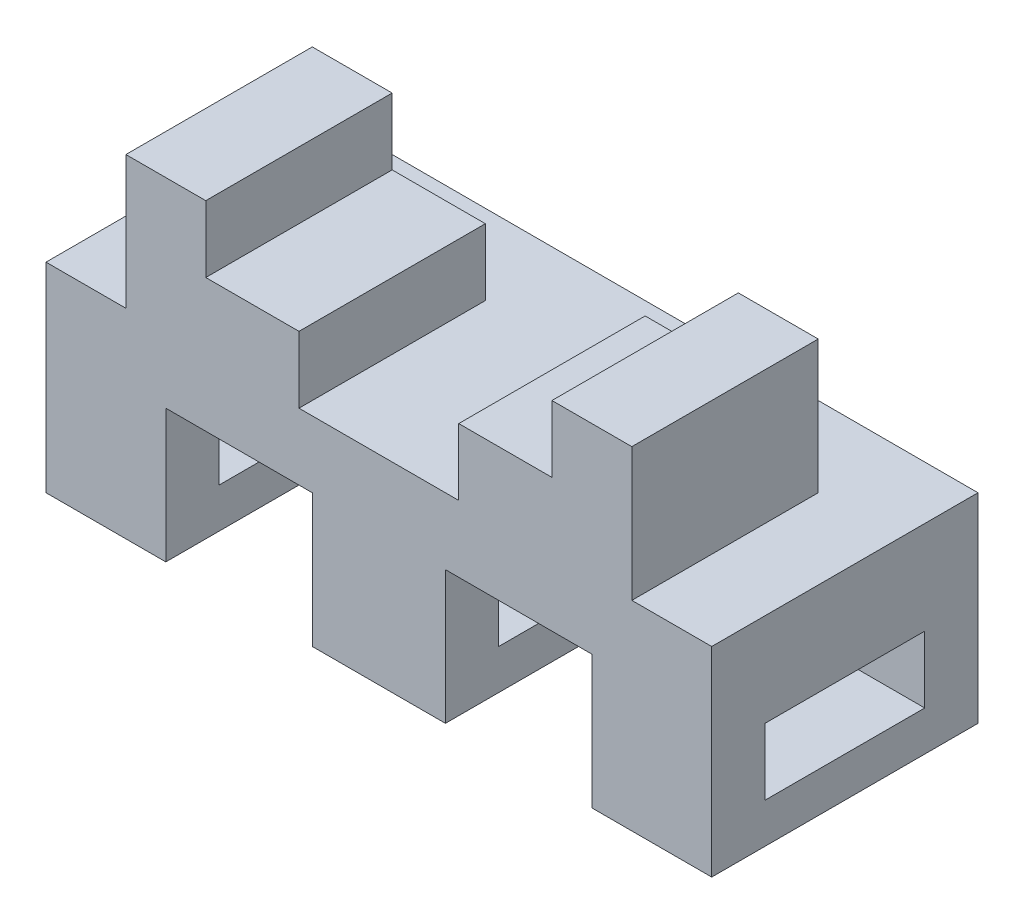
ISO-10303-21;
HEADER;
FILE_DESCRIPTION(('STEP AP214'),'2;1');
FILE_NAME('part.step','',(''),(''),'','','');
FILE_SCHEMA(('AUTOMOTIVE_DESIGN { 1 0 10303 214 1 1 1 1 }'));
ENDSEC;
DATA;
#1=APPLICATION_CONTEXT('core data for automotive mechanical design processes');
#2=APPLICATION_PROTOCOL_DEFINITION('international standard','automotive_design',2000,#1);
#3=PRODUCT_CONTEXT('',#1,'mechanical');
#4=PRODUCT('Part','Part','',(#3));
#5=PRODUCT_RELATED_PRODUCT_CATEGORY('part','',(#4));
#6=PRODUCT_DEFINITION_FORMATION('','',#4);
#7=PRODUCT_DEFINITION_CONTEXT('part definition',#1,'design');
#8=PRODUCT_DEFINITION('design','',#6,#7);
#9=PRODUCT_DEFINITION_SHAPE('','',#8);
#10=(LENGTH_UNIT() NAMED_UNIT(*) SI_UNIT(.MILLI.,.METRE.));
#11=(NAMED_UNIT(*) PLANE_ANGLE_UNIT() SI_UNIT($,.RADIAN.));
#12=(NAMED_UNIT(*) SI_UNIT($,.STERADIAN.) SOLID_ANGLE_UNIT());
#13=UNCERTAINTY_MEASURE_WITH_UNIT(LENGTH_MEASURE(1.E-05),#10,'distance_accuracy_value','');
#14=(GEOMETRIC_REPRESENTATION_CONTEXT(3) GLOBAL_UNCERTAINTY_ASSIGNED_CONTEXT((#13)) GLOBAL_UNIT_ASSIGNED_CONTEXT((#10,
#11,#12)) REPRESENTATION_CONTEXT('',''));
#15=CARTESIAN_POINT('',(0.,0.,0.));
#16=DIRECTION('',(0.,0.,1.));
#17=DIRECTION('',(1.,0.,0.));
#18=AXIS2_PLACEMENT_3D('',#15,#16,#17);
#19=CARTESIAN_POINT('',(0.,38.1,0.));
#20=DIRECTION('',(0.,-1.,0.));
#21=DIRECTION('',(0.,0.,-1.));
#22=AXIS2_PLACEMENT_3D('',#19,#20,#21);
#23=PLANE('',#22);
#24=DIRECTION('',(0.,0.,1.));
#25=VECTOR('',#24,1.);
#26=CARTESIAN_POINT('',(48.2600000000001,38.1000000000001,-10.16));
#27=LINE('',#26,#25);
#28=CARTESIAN_POINT('',(48.2600000000001,38.1,-10.16));
#29=VERTEX_POINT('',#28);
#30=CARTESIAN_POINT('',(48.2600000000001,38.1000000000001,25.4));
#31=VERTEX_POINT('',#30);
#32=EDGE_CURVE('E279',#29,#31,#27,.T.);
#33=ORIENTED_EDGE('',*,*,#32,.T.);
#34=DIRECTION('',(1.,0.,0.));
#35=VECTOR('',#34,1.);
#36=CARTESIAN_POINT('',(-63.5000000000001,38.1,25.4));
#37=LINE('',#36,#35);
#38=CARTESIAN_POINT('',(63.4999999999999,38.1,25.4));
#39=VERTEX_POINT('',#38);
#40=EDGE_CURVE('E541',#31,#39,#37,.T.);
#41=ORIENTED_EDGE('',*,*,#40,.T.);
#42=DIRECTION('',(0.,0.,-1.));
#43=VECTOR('',#42,1.);
#44=CARTESIAN_POINT('',(63.4999999999999,38.1,25.4));
#45=LINE('',#44,#43);
#46=CARTESIAN_POINT('',(63.4999999999999,38.1,-25.4));
#47=VERTEX_POINT('',#46);
#48=EDGE_CURVE('E530',#39,#47,#45,.T.);
#49=ORIENTED_EDGE('',*,*,#48,.T.);
#50=DIRECTION('',(-1.,0.,0.));
#51=VECTOR('',#50,1.);
#52=CARTESIAN_POINT('',(-63.5000000000001,38.1,-25.4));
#53=LINE('',#52,#51);
#54=CARTESIAN_POINT('',(-63.5000000000001,38.1,-25.4));
#55=VERTEX_POINT('',#54);
#56=EDGE_CURVE('E534',#47,#55,#53,.T.);
#57=ORIENTED_EDGE('',*,*,#56,.T.);
#58=DIRECTION('',(0.,0.,1.));
#59=VECTOR('',#58,1.);
#60=CARTESIAN_POINT('',(-63.5000000000001,38.1,25.4));
#61=LINE('',#60,#59);
#62=CARTESIAN_POINT('',(-63.5000000000001,38.1,25.4));
#63=VERTEX_POINT('',#62);
#64=EDGE_CURVE('E538',#55,#63,#61,.T.);
#65=ORIENTED_EDGE('',*,*,#64,.T.);
#66=CARTESIAN_POINT('',(-48.2600000000001,38.1,25.4));
#67=VERTEX_POINT('',#66);
#68=EDGE_CURVE('E542',#63,#67,#37,.T.);
#69=ORIENTED_EDGE('',*,*,#68,.T.);
#70=DIRECTION('',(0.,0.,1.));
#71=VECTOR('',#70,1.);
#72=CARTESIAN_POINT('',(-48.2600000000001,38.1,-10.16));
#73=LINE('',#72,#71);
#74=CARTESIAN_POINT('',(-48.2600000000001,38.1,-10.16));
#75=VERTEX_POINT('',#74);
#76=EDGE_CURVE('E357',#75,#67,#73,.T.);
#77=ORIENTED_EDGE('',*,*,#76,.F.);
#78=DIRECTION('',(-1.,0.,0.));
#79=VECTOR('',#78,1.);
#80=CARTESIAN_POINT('',(-63.5000000000001,38.1,-10.16));
#81=LINE('',#80,#79);
#82=CARTESIAN_POINT('',(-15.2400000000001,38.1,-10.16));
#83=VERTEX_POINT('',#82);
#84=EDGE_CURVE('E307',#83,#75,#81,.T.);
#85=ORIENTED_EDGE('',*,*,#84,.F.);
#86=DIRECTION('',(0.,0.,1.));
#87=VECTOR('',#86,1.);
#88=CARTESIAN_POINT('',(-15.2400000000001,38.1,-10.16));
#89=LINE('',#88,#87);
#90=CARTESIAN_POINT('',(-15.2400000000001,38.1,25.4));
#91=VERTEX_POINT('',#90);
#92=EDGE_CURVE('E326',#83,#91,#89,.T.);
#93=ORIENTED_EDGE('',*,*,#92,.T.);
#94=CARTESIAN_POINT('',(15.2400000000001,38.1,25.4));
#95=VERTEX_POINT('',#94);
#96=EDGE_CURVE('E547',#91,#95,#37,.T.);
#97=ORIENTED_EDGE('',*,*,#96,.T.);
#98=DIRECTION('',(0.,0.,1.));
#99=VECTOR('',#98,1.);
#100=CARTESIAN_POINT('',(15.2400000000001,38.1000000000001,-10.16));
#101=LINE('',#100,#99);
#102=CARTESIAN_POINT('',(15.2400000000001,38.1,-10.16));
#103=VERTEX_POINT('',#102);
#104=EDGE_CURVE('E60',#103,#95,#101,.T.);
#105=ORIENTED_EDGE('',*,*,#104,.F.);
#106=DIRECTION('',(-1.,0.,0.));
#107=VECTOR('',#106,1.);
#108=CARTESIAN_POINT('',(-63.5000000000001,38.1,-10.16));
#109=LINE('',#108,#107);
#110=EDGE_CURVE('E55',#29,#103,#109,.T.);
#111=ORIENTED_EDGE('',*,*,#110,.F.);
#112=EDGE_LOOP('',(#33,#41,#49,#57,#65,#69,#77,#85,#93,#97,#105,#111));
#113=FACE_BOUND('',#112,.T.);
#114=ADVANCED_FACE('F39',(#113),#23,.F.);
#115=CARTESIAN_POINT('',(0.,0.,0.));
#116=DIRECTION('',(0.,-1.,0.));
#117=DIRECTION('',(0.,0.,-1.));
#118=AXIS2_PLACEMENT_3D('',#115,#116,#117);
#119=PLANE('',#118);
#120=DIRECTION('',(0.,0.,1.));
#121=VECTOR('',#120,1.);
#122=CARTESIAN_POINT('',(-40.6400000000001,0.,-25.4));
#123=LINE('',#122,#121);
#124=CARTESIAN_POINT('',(-40.6400000000001,0.,-25.4));
#125=VERTEX_POINT('',#124);
#126=CARTESIAN_POINT('',(-40.6400000000001,0.,25.4));
#127=VERTEX_POINT('',#126);
#128=EDGE_CURVE('E483',#125,#127,#123,.T.);
#129=ORIENTED_EDGE('',*,*,#128,.T.);
#130=DIRECTION('',(1.,0.,0.));
#131=VECTOR('',#130,1.);
#132=CARTESIAN_POINT('',(-63.5000000000001,0.,25.4));
#133=LINE('',#132,#131);
#134=CARTESIAN_POINT('',(-63.5000000000001,0.,25.4));
#135=VERTEX_POINT('',#134);
#136=EDGE_CURVE('E535',#135,#127,#133,.T.);
#137=ORIENTED_EDGE('',*,*,#136,.F.);
#138=DIRECTION('',(0.,0.,1.));
#139=VECTOR('',#138,1.);
#140=CARTESIAN_POINT('',(-63.5000000000001,0.,25.4));
#141=LINE('',#140,#139);
#142=CARTESIAN_POINT('',(-63.5000000000001,0.,-25.4));
#143=VERTEX_POINT('',#142);
#144=EDGE_CURVE('E556',#143,#135,#141,.T.);
#145=ORIENTED_EDGE('',*,*,#144,.F.);
#146=DIRECTION('',(-1.,0.,0.));
#147=VECTOR('',#146,1.);
#148=CARTESIAN_POINT('',(-63.5000000000001,0.,-25.4));
#149=LINE('',#148,#147);
#150=EDGE_CURVE('E551',#125,#143,#149,.T.);
#151=ORIENTED_EDGE('',*,*,#150,.F.);
#152=EDGE_LOOP('',(#129,#137,#145,#151));
#153=FACE_BOUND('',#152,.T.);
#154=ADVANCED_FACE('F665',(#153),#119,.T.);
#155=DIRECTION('',(0.,0.,1.));
#156=VECTOR('',#155,1.);
#157=CARTESIAN_POINT('',(-12.7000000000001,0.,-25.4));
#158=LINE('',#157,#156);
#159=CARTESIAN_POINT('',(-12.7000000000001,0.,-25.4));
#160=VERTEX_POINT('',#159);
#161=CARTESIAN_POINT('',(-12.7000000000001,0.,25.4));
#162=VERTEX_POINT('',#161);
#163=EDGE_CURVE('E482',#160,#162,#158,.T.);
#164=ORIENTED_EDGE('',*,*,#163,.F.);
#165=CARTESIAN_POINT('',(12.6999999999999,0.,-25.4));
#166=VERTEX_POINT('',#165);
#167=EDGE_CURVE('E557',#166,#160,#149,.T.);
#168=ORIENTED_EDGE('',*,*,#167,.F.);
#169=DIRECTION('',(0.,0.,1.));
#170=VECTOR('',#169,1.);
#171=CARTESIAN_POINT('',(12.6999999999999,0.,-25.4));
#172=LINE('',#171,#170);
#173=CARTESIAN_POINT('',(12.6999999999999,0.,25.4));
#174=VERTEX_POINT('',#173);
#175=EDGE_CURVE('E463',#166,#174,#172,.T.);
#176=ORIENTED_EDGE('',*,*,#175,.T.);
#177=EDGE_CURVE('E564',#162,#174,#133,.T.);
#178=ORIENTED_EDGE('',*,*,#177,.F.);
#179=EDGE_LOOP('',(#164,#168,#176,#178));
#180=FACE_BOUND('',#179,.T.);
#181=ADVANCED_FACE('F652',(#180),#119,.T.);
#182=CARTESIAN_POINT('',(63.4999999999999,38.1,25.4));
#183=DIRECTION('',(-1.,0.,0.));
#184=DIRECTION('',(0.,0.,1.));
#185=AXIS2_PLACEMENT_3D('',#182,#183,#184);
#186=PLANE('',#185);
#187=DIRECTION('',(0.,-1.,0.));
#188=VECTOR('',#187,1.);
#189=CARTESIAN_POINT('',(63.4999999999999,20.32,-15.24));
#190=LINE('',#189,#188);
#191=CARTESIAN_POINT('',(63.4999999999999,20.32,-15.24));
#192=VERTEX_POINT('',#191);
#193=CARTESIAN_POINT('',(63.4999999999999,7.62000000000001,-15.24));
#194=VERTEX_POINT('',#193);
#195=EDGE_CURVE('E364',#192,#194,#190,.T.);
#196=ORIENTED_EDGE('',*,*,#195,.T.);
#197=DIRECTION('',(0.,0.,-1.));
#198=VECTOR('',#197,1.);
#199=CARTESIAN_POINT('',(63.4999999999999,7.62,15.24));
#200=LINE('',#199,#198);
#201=CARTESIAN_POINT('',(63.4999999999999,7.62,15.24));
#202=VERTEX_POINT('',#201);
#203=EDGE_CURVE('E361',#202,#194,#200,.T.);
#204=ORIENTED_EDGE('',*,*,#203,.F.);
#205=DIRECTION('',(0.,-1.,0.));
#206=VECTOR('',#205,1.);
#207=CARTESIAN_POINT('',(63.4999999999999,20.32,15.24));
#208=LINE('',#207,#206);
#209=CARTESIAN_POINT('',(63.4999999999999,20.32,15.24));
#210=VERTEX_POINT('',#209);
#211=EDGE_CURVE('E372',#210,#202,#208,.T.);
#212=ORIENTED_EDGE('',*,*,#211,.F.);
#213=DIRECTION('',(0.,0.,-1.));
#214=VECTOR('',#213,1.);
#215=CARTESIAN_POINT('',(63.4999999999999,20.32,15.24));
#216=LINE('',#215,#214);
#217=EDGE_CURVE('E368',#210,#192,#216,.T.);
#218=ORIENTED_EDGE('',*,*,#217,.T.);
#219=EDGE_LOOP('',(#196,#204,#212,#218));
#220=FACE_BOUND('',#219,.T.);
#221=DIRECTION('',(0.,0.,-1.));
#222=VECTOR('',#221,1.);
#223=CARTESIAN_POINT('',(63.4999999999999,0.,25.4));
#224=LINE('',#223,#222);
#225=CARTESIAN_POINT('',(63.4999999999999,0.,25.4));
#226=VERTEX_POINT('',#225);
#227=CARTESIAN_POINT('',(63.4999999999999,0.,-25.4));
#228=VERTEX_POINT('',#227);
#229=EDGE_CURVE('E487',#226,#228,#224,.T.);
#230=ORIENTED_EDGE('',*,*,#229,.T.);
#231=DIRECTION('',(0.,-1.,0.));
#232=VECTOR('',#231,1.);
#233=CARTESIAN_POINT('',(63.4999999999999,38.1,-25.4));
#234=LINE('',#233,#232);
#235=EDGE_CURVE('E576',#47,#228,#234,.T.);
#236=ORIENTED_EDGE('',*,*,#235,.F.);
#237=ORIENTED_EDGE('',*,*,#48,.F.);
#238=DIRECTION('',(0.,-1.,0.));
#239=VECTOR('',#238,1.);
#240=CARTESIAN_POINT('',(63.4999999999999,38.1,25.4));
#241=LINE('',#240,#239);
#242=EDGE_CURVE('E546',#39,#226,#241,.T.);
#243=ORIENTED_EDGE('',*,*,#242,.T.);
#244=EDGE_LOOP('',(#230,#236,#237,#243));
#245=FACE_BOUND('',#244,.T.);
#246=ADVANCED_FACE('F41',(#220,#245),#186,.F.);
#247=CARTESIAN_POINT('',(-63.5000000000001,38.1,-25.4));
#248=DIRECTION('',(0.,0.,1.));
#249=DIRECTION('',(1.,0.,0.));
#250=AXIS2_PLACEMENT_3D('',#247,#248,#249);
#251=PLANE('',#250);
#252=DIRECTION('',(-1.,0.,0.));
#253=VECTOR('',#252,1.);
#254=CARTESIAN_POINT('',(-40.6400000000001,25.4,-25.4));
#255=LINE('',#254,#253);
#256=CARTESIAN_POINT('',(-12.7000000000001,25.4,-25.4));
#257=VERTEX_POINT('',#256);
#258=CARTESIAN_POINT('',(-40.6400000000001,25.4,-25.4));
#259=VERTEX_POINT('',#258);
#260=EDGE_CURVE('E474',#257,#259,#255,.T.);
#261=ORIENTED_EDGE('',*,*,#260,.T.);
#262=DIRECTION('',(0.,-1.,0.));
#263=VECTOR('',#262,1.);
#264=CARTESIAN_POINT('',(-40.6400000000001,0.,-25.4));
#265=LINE('',#264,#263);
#266=EDGE_CURVE('E478',#259,#125,#265,.T.);
#267=ORIENTED_EDGE('',*,*,#266,.T.);
#268=ORIENTED_EDGE('',*,*,#150,.T.);
#269=DIRECTION('',(0.,-1.,0.));
#270=VECTOR('',#269,1.);
#271=CARTESIAN_POINT('',(-63.5000000000001,38.1,-25.4));
#272=LINE('',#271,#270);
#273=EDGE_CURVE('E572',#55,#143,#272,.T.);
#274=ORIENTED_EDGE('',*,*,#273,.F.);
#275=ORIENTED_EDGE('',*,*,#56,.F.);
#276=ORIENTED_EDGE('',*,*,#235,.T.);
#277=CARTESIAN_POINT('',(40.6399999999999,0.,-25.4));
#278=VERTEX_POINT('',#277);
#279=EDGE_CURVE('E552',#228,#278,#149,.T.);
#280=ORIENTED_EDGE('',*,*,#279,.T.);
#281=DIRECTION('',(0.,1.,0.));
#282=VECTOR('',#281,1.);
#283=CARTESIAN_POINT('',(40.6399999999999,25.4,-25.4));
#284=LINE('',#283,#282);
#285=CARTESIAN_POINT('',(40.6399999999999,25.4,-25.4));
#286=VERTEX_POINT('',#285);
#287=EDGE_CURVE('E506',#278,#286,#284,.T.);
#288=ORIENTED_EDGE('',*,*,#287,.T.);
#289=DIRECTION('',(-1.,0.,0.));
#290=VECTOR('',#289,1.);
#291=CARTESIAN_POINT('',(12.6999999999999,25.4,-25.4));
#292=LINE('',#291,#290);
#293=CARTESIAN_POINT('',(12.6999999999999,25.4,-25.4));
#294=VERTEX_POINT('',#293);
#295=EDGE_CURVE('E510',#286,#294,#292,.T.);
#296=ORIENTED_EDGE('',*,*,#295,.T.);
#297=DIRECTION('',(0.,-1.,0.));
#298=VECTOR('',#297,1.);
#299=CARTESIAN_POINT('',(12.6999999999999,0.,-25.4));
#300=LINE('',#299,#298);
#301=EDGE_CURVE('E514',#294,#166,#300,.T.);
#302=ORIENTED_EDGE('',*,*,#301,.T.);
#303=ORIENTED_EDGE('',*,*,#167,.T.);
#304=DIRECTION('',(0.,1.,0.));
#305=VECTOR('',#304,1.);
#306=CARTESIAN_POINT('',(-12.7000000000001,25.4,-25.4));
#307=LINE('',#306,#305);
#308=EDGE_CURVE('E470',#160,#257,#307,.T.);
#309=ORIENTED_EDGE('',*,*,#308,.T.);
#310=EDGE_LOOP('',(#261,#267,#268,#274,#275,#276,#280,#288,#296,#302,#303,#309));
#311=FACE_BOUND('',#310,.T.);
#312=ADVANCED_FACE('F649',(#311),#251,.F.);
#313=CARTESIAN_POINT('',(-63.5000000000001,38.1,25.4));
#314=DIRECTION('',(1.,0.,0.));
#315=DIRECTION('',(0.,0.,-1.));
#316=AXIS2_PLACEMENT_3D('',#313,#314,#315);
#317=PLANE('',#316);
#318=DIRECTION('',(0.,-1.,0.));
#319=VECTOR('',#318,1.);
#320=CARTESIAN_POINT('',(-63.5000000000001,20.32,15.24));
#321=LINE('',#320,#319);
#322=CARTESIAN_POINT('',(-63.5000000000001,20.32,15.24));
#323=VERTEX_POINT('',#322);
#324=CARTESIAN_POINT('',(-63.5000000000001,7.62,15.24));
#325=VERTEX_POINT('',#324);
#326=EDGE_CURVE('E387',#323,#325,#321,.T.);
#327=ORIENTED_EDGE('',*,*,#326,.T.);
#328=DIRECTION('',(0.,0.,-1.));
#329=VECTOR('',#328,1.);
#330=CARTESIAN_POINT('',(-63.5000000000001,7.62,15.24));
#331=LINE('',#330,#329);
#332=CARTESIAN_POINT('',(-63.5000000000001,7.62,-15.24));
#333=VERTEX_POINT('',#332);
#334=EDGE_CURVE('E376',#325,#333,#331,.T.);
#335=ORIENTED_EDGE('',*,*,#334,.T.);
#336=DIRECTION('',(0.,-1.,0.));
#337=VECTOR('',#336,1.);
#338=CARTESIAN_POINT('',(-63.5000000000001,20.32,-15.24));
#339=LINE('',#338,#337);
#340=CARTESIAN_POINT('',(-63.5000000000001,20.32,-15.24));
#341=VERTEX_POINT('',#340);
#342=EDGE_CURVE('E380',#341,#333,#339,.T.);
#343=ORIENTED_EDGE('',*,*,#342,.F.);
#344=DIRECTION('',(0.,0.,-1.));
#345=VECTOR('',#344,1.);
#346=CARTESIAN_POINT('',(-63.5000000000001,20.32,15.24));
#347=LINE('',#346,#345);
#348=EDGE_CURVE('E383',#323,#341,#347,.T.);
#349=ORIENTED_EDGE('',*,*,#348,.F.);
#350=EDGE_LOOP('',(#327,#335,#343,#349));
#351=FACE_BOUND('',#350,.T.);
#352=ORIENTED_EDGE('',*,*,#144,.T.);
#353=DIRECTION('',(0.,-1.,0.));
#354=VECTOR('',#353,1.);
#355=CARTESIAN_POINT('',(-63.5000000000001,38.1,25.4));
#356=LINE('',#355,#354);
#357=EDGE_CURVE('E568',#63,#135,#356,.T.);
#358=ORIENTED_EDGE('',*,*,#357,.F.);
#359=ORIENTED_EDGE('',*,*,#64,.F.);
#360=ORIENTED_EDGE('',*,*,#273,.T.);
#361=EDGE_LOOP('',(#352,#358,#359,#360));
#362=FACE_BOUND('',#361,.T.);
#363=ADVANCED_FACE('F662',(#351,#362),#317,.F.);
#364=CARTESIAN_POINT('',(-63.5000000000001,38.1,25.4));
#365=DIRECTION('',(0.,0.,-1.));
#366=DIRECTION('',(-1.,0.,0.));
#367=AXIS2_PLACEMENT_3D('',#364,#365,#366);
#368=PLANE('',#367);
#369=ORIENTED_EDGE('',*,*,#136,.T.);
#370=DIRECTION('',(0.,-1.,0.));
#371=VECTOR('',#370,1.);
#372=CARTESIAN_POINT('',(-40.6400000000001,0.,25.4));
#373=LINE('',#372,#371);
#374=CARTESIAN_POINT('',(-40.6400000000001,25.4,25.4));
#375=VERTEX_POINT('',#374);
#376=EDGE_CURVE('E467',#375,#127,#373,.T.);
#377=ORIENTED_EDGE('',*,*,#376,.F.);
#378=DIRECTION('',(-1.,0.,0.));
#379=VECTOR('',#378,1.);
#380=CARTESIAN_POINT('',(-40.6400000000001,25.4,25.4));
#381=LINE('',#380,#379);
#382=CARTESIAN_POINT('',(-12.7000000000001,25.4,25.4));
#383=VERTEX_POINT('',#382);
#384=EDGE_CURVE('E462',#383,#375,#381,.T.);
#385=ORIENTED_EDGE('',*,*,#384,.F.);
#386=DIRECTION('',(0.,1.,0.));
#387=VECTOR('',#386,1.);
#388=CARTESIAN_POINT('',(-12.7000000000001,25.4,25.4));
#389=LINE('',#388,#387);
#390=EDGE_CURVE('E458',#162,#383,#389,.T.);
#391=ORIENTED_EDGE('',*,*,#390,.F.);
#392=ORIENTED_EDGE('',*,*,#177,.T.);
#393=DIRECTION('',(0.,-1.,0.));
#394=VECTOR('',#393,1.);
#395=CARTESIAN_POINT('',(12.6999999999999,0.,25.4));
#396=LINE('',#395,#394);
#397=CARTESIAN_POINT('',(12.6999999999999,25.4,25.4));
#398=VERTEX_POINT('',#397);
#399=EDGE_CURVE('E503',#398,#174,#396,.T.);
#400=ORIENTED_EDGE('',*,*,#399,.F.);
#401=DIRECTION('',(-1.,0.,0.));
#402=VECTOR('',#401,1.);
#403=CARTESIAN_POINT('',(12.6999999999999,25.4,25.4));
#404=LINE('',#403,#402);
#405=CARTESIAN_POINT('',(40.6399999999999,25.4,25.4));
#406=VERTEX_POINT('',#405);
#407=EDGE_CURVE('E499',#406,#398,#404,.T.);
#408=ORIENTED_EDGE('',*,*,#407,.F.);
#409=DIRECTION('',(0.,1.,0.));
#410=VECTOR('',#409,1.);
#411=CARTESIAN_POINT('',(40.6399999999999,25.4,25.4));
#412=LINE('',#411,#410);
#413=CARTESIAN_POINT('',(40.6399999999999,0.,25.4));
#414=VERTEX_POINT('',#413);
#415=EDGE_CURVE('E457',#414,#406,#412,.T.);
#416=ORIENTED_EDGE('',*,*,#415,.F.);
#417=EDGE_CURVE('E560',#414,#226,#133,.T.);
#418=ORIENTED_EDGE('',*,*,#417,.T.);
#419=ORIENTED_EDGE('',*,*,#242,.F.);
#420=ORIENTED_EDGE('',*,*,#40,.F.);
#421=DIRECTION('',(0.,-1.,0.));
#422=VECTOR('',#421,1.);
#423=CARTESIAN_POINT('',(48.2600000000001,38.0999999999999,25.4));
#424=LINE('',#423,#422);
#425=CARTESIAN_POINT('',(48.2600000000001,63.5,25.4));
#426=VERTEX_POINT('',#425);
#427=EDGE_CURVE('E1007',#426,#31,#424,.T.);
#428=ORIENTED_EDGE('',*,*,#427,.F.);
#429=DIRECTION('',(1.,0.,0.));
#430=VECTOR('',#429,1.);
#431=CARTESIAN_POINT('',(-63.5000000000001,63.5,25.4));
#432=LINE('',#431,#430);
#433=CARTESIAN_POINT('',(33.0200000000001,63.5,25.4));
#434=VERTEX_POINT('',#433);
#435=EDGE_CURVE('E296',#434,#426,#432,.T.);
#436=ORIENTED_EDGE('',*,*,#435,.F.);
#437=DIRECTION('',(0.,1.,0.));
#438=VECTOR('',#437,1.);
#439=CARTESIAN_POINT('',(33.0200000000001,38.0999999999999,25.4));
#440=LINE('',#439,#438);
#441=CARTESIAN_POINT('',(33.0200000000001,50.8,25.4));
#442=VERTEX_POINT('',#441);
#443=EDGE_CURVE('E292',#442,#434,#440,.T.);
#444=ORIENTED_EDGE('',*,*,#443,.F.);
#445=DIRECTION('',(1.,0.,0.));
#446=VECTOR('',#445,1.);
#447=CARTESIAN_POINT('',(-63.5000000000001,50.7999999999999,25.4));
#448=LINE('',#447,#446);
#449=CARTESIAN_POINT('',(15.2400000000001,50.8,25.4));
#450=VERTEX_POINT('',#449);
#451=EDGE_CURVE('E1003',#450,#442,#448,.T.);
#452=ORIENTED_EDGE('',*,*,#451,.F.);
#453=DIRECTION('',(0.,1.,0.));
#454=VECTOR('',#453,1.);
#455=CARTESIAN_POINT('',(15.2400000000001,38.1,25.4));
#456=LINE('',#455,#454);
#457=EDGE_CURVE('E1011',#95,#450,#456,.T.);
#458=ORIENTED_EDGE('',*,*,#457,.F.);
#459=ORIENTED_EDGE('',*,*,#96,.F.);
#460=DIRECTION('',(0.,-1.,0.));
#461=VECTOR('',#460,1.);
#462=CARTESIAN_POINT('',(-15.2400000000001,38.1,25.4));
#463=LINE('',#462,#461);
#464=CARTESIAN_POINT('',(-15.2400000000001,50.8,25.4));
#465=VERTEX_POINT('',#464);
#466=EDGE_CURVE('E312',#465,#91,#463,.T.);
#467=ORIENTED_EDGE('',*,*,#466,.F.);
#468=DIRECTION('',(1.,0.,0.));
#469=VECTOR('',#468,1.);
#470=CARTESIAN_POINT('',(-63.5000000000001,50.8000000000001,25.4));
#471=LINE('',#470,#469);
#472=CARTESIAN_POINT('',(-33.0200000000001,50.8,25.4));
#473=VERTEX_POINT('',#472);
#474=EDGE_CURVE('E333',#473,#465,#471,.T.);
#475=ORIENTED_EDGE('',*,*,#474,.F.);
#476=DIRECTION('',(0.,-1.,0.));
#477=VECTOR('',#476,1.);
#478=CARTESIAN_POINT('',(-33.0200000000001,38.1,25.4));
#479=LINE('',#478,#477);
#480=CARTESIAN_POINT('',(-33.0200000000001,63.5,25.4));
#481=VERTEX_POINT('',#480);
#482=EDGE_CURVE('E330',#481,#473,#479,.T.);
#483=ORIENTED_EDGE('',*,*,#482,.F.);
#484=DIRECTION('',(1.,0.,0.));
#485=VECTOR('',#484,1.);
#486=CARTESIAN_POINT('',(-63.5000000000001,63.5,25.4));
#487=LINE('',#486,#485);
#488=CARTESIAN_POINT('',(-48.2600000000001,63.5,25.4));
#489=VERTEX_POINT('',#488);
#490=EDGE_CURVE('E302',#489,#481,#487,.T.);
#491=ORIENTED_EDGE('',*,*,#490,.F.);
#492=DIRECTION('',(0.,1.,0.));
#493=VECTOR('',#492,1.);
#494=CARTESIAN_POINT('',(-48.2600000000001,38.1,25.4));
#495=LINE('',#494,#493);
#496=EDGE_CURVE('E298',#67,#489,#495,.T.);
#497=ORIENTED_EDGE('',*,*,#496,.F.);
#498=ORIENTED_EDGE('',*,*,#68,.F.);
#499=ORIENTED_EDGE('',*,*,#357,.T.);
#500=EDGE_LOOP('',(#369,#377,#385,#391,#392,#400,#408,#416,#418,#419,#420,#428,#436,#444,#452,
#458,#459,#467,#475,#483,#491,#497,#498,#499));
#501=FACE_BOUND('',#500,.T.);
#502=ADVANCED_FACE('F668',(#501),#368,.F.);
#503=DIRECTION('',(0.,0.,1.));
#504=VECTOR('',#503,1.);
#505=CARTESIAN_POINT('',(40.6399999999999,0.,-25.4));
#506=LINE('',#505,#504);
#507=EDGE_CURVE('E518',#278,#414,#506,.T.);
#508=ORIENTED_EDGE('',*,*,#507,.F.);
#509=ORIENTED_EDGE('',*,*,#279,.F.);
#510=ORIENTED_EDGE('',*,*,#229,.F.);
#511=ORIENTED_EDGE('',*,*,#417,.F.);
#512=EDGE_LOOP('',(#508,#509,#510,#511));
#513=FACE_BOUND('',#512,.T.);
#514=ADVANCED_FACE('F639',(#513),#119,.T.);
#515=CARTESIAN_POINT('',(12.6999999999999,0.,-25.4));
#516=DIRECTION('',(-1.,0.,0.));
#517=DIRECTION('',(0.,0.,1.));
#518=AXIS2_PLACEMENT_3D('',#515,#516,#517);
#519=PLANE('',#518);
#520=DIRECTION('',(0.,1.,0.));
#521=VECTOR('',#520,1.);
#522=CARTESIAN_POINT('',(12.6999999999999,0.,-15.24));
#523=LINE('',#522,#521);
#524=CARTESIAN_POINT('',(12.6999999999999,7.62,-15.24));
#525=VERTEX_POINT('',#524);
#526=CARTESIAN_POINT('',(12.6999999999999,20.32,-15.24));
#527=VERTEX_POINT('',#526);
#528=EDGE_CURVE('E420',#525,#527,#523,.T.);
#529=ORIENTED_EDGE('',*,*,#528,.F.);
#530=DIRECTION('',(0.,0.,1.));
#531=VECTOR('',#530,1.);
#532=CARTESIAN_POINT('',(12.6999999999999,7.62,-25.4));
#533=LINE('',#532,#531);
#534=CARTESIAN_POINT('',(12.6999999999999,7.62,15.24));
#535=VERTEX_POINT('',#534);
#536=EDGE_CURVE('E453',#525,#535,#533,.T.);
#537=ORIENTED_EDGE('',*,*,#536,.T.);
#538=DIRECTION('',(0.,1.,0.));
#539=VECTOR('',#538,1.);
#540=CARTESIAN_POINT('',(12.6999999999999,0.,15.24));
#541=LINE('',#540,#539);
#542=CARTESIAN_POINT('',(12.6999999999999,20.32,15.24));
#543=VERTEX_POINT('',#542);
#544=EDGE_CURVE('E441',#535,#543,#541,.T.);
#545=ORIENTED_EDGE('',*,*,#544,.T.);
#546=DIRECTION('',(0.,0.,1.));
#547=VECTOR('',#546,1.);
#548=CARTESIAN_POINT('',(12.6999999999999,20.32,-25.4));
#549=LINE('',#548,#547);
#550=EDGE_CURVE('E430',#527,#543,#549,.T.);
#551=ORIENTED_EDGE('',*,*,#550,.F.);
#552=EDGE_LOOP('',(#529,#537,#545,#551));
#553=FACE_BOUND('',#552,.T.);
#554=ORIENTED_EDGE('',*,*,#175,.F.);
#555=ORIENTED_EDGE('',*,*,#301,.F.);
#556=DIRECTION('',(0.,0.,1.));
#557=VECTOR('',#556,1.);
#558=CARTESIAN_POINT('',(12.6999999999999,25.4,-25.4));
#559=LINE('',#558,#557);
#560=EDGE_CURVE('E522',#294,#398,#559,.T.);
#561=ORIENTED_EDGE('',*,*,#560,.T.);
#562=ORIENTED_EDGE('',*,*,#399,.T.);
#563=EDGE_LOOP('',(#554,#555,#561,#562));
#564=FACE_BOUND('',#563,.T.);
#565=ADVANCED_FACE('F635',(#553,#564),#519,.F.);
#566=CARTESIAN_POINT('',(12.6999999999999,25.4,-25.4));
#567=DIRECTION('',(0.,1.,0.));
#568=DIRECTION('',(0.,0.,1.));
#569=AXIS2_PLACEMENT_3D('',#566,#567,#568);
#570=PLANE('',#569);
#571=ORIENTED_EDGE('',*,*,#560,.F.);
#572=ORIENTED_EDGE('',*,*,#295,.F.);
#573=DIRECTION('',(0.,0.,1.));
#574=VECTOR('',#573,1.);
#575=CARTESIAN_POINT('',(40.6399999999999,25.4,-25.4));
#576=LINE('',#575,#574);
#577=EDGE_CURVE('E525',#286,#406,#576,.T.);
#578=ORIENTED_EDGE('',*,*,#577,.T.);
#579=ORIENTED_EDGE('',*,*,#407,.T.);
#580=EDGE_LOOP('',(#571,#572,#578,#579));
#581=FACE_BOUND('',#580,.T.);
#582=ADVANCED_FACE('F638',(#581),#570,.F.);
#583=CARTESIAN_POINT('',(40.6399999999999,25.4,-25.4));
#584=DIRECTION('',(1.,0.,0.));
#585=DIRECTION('',(0.,0.,-1.));
#586=AXIS2_PLACEMENT_3D('',#583,#584,#585);
#587=PLANE('',#586);
#588=DIRECTION('',(0.,-1.,0.));
#589=VECTOR('',#588,1.);
#590=CARTESIAN_POINT('',(40.6399999999999,25.4,15.24));
#591=LINE('',#590,#589);
#592=CARTESIAN_POINT('',(40.6399999999999,20.32,15.24));
#593=VERTEX_POINT('',#592);
#594=CARTESIAN_POINT('',(40.6399999999999,7.62,15.24));
#595=VERTEX_POINT('',#594);
#596=EDGE_CURVE('E437',#593,#595,#591,.T.);
#597=ORIENTED_EDGE('',*,*,#596,.T.);
#598=DIRECTION('',(0.,0.,-1.));
#599=VECTOR('',#598,1.);
#600=CARTESIAN_POINT('',(40.6399999999999,7.62,-25.4));
#601=LINE('',#600,#599);
#602=CARTESIAN_POINT('',(40.6399999999999,7.62,-15.24));
#603=VERTEX_POINT('',#602);
#604=EDGE_CURVE('E449',#595,#603,#601,.T.);
#605=ORIENTED_EDGE('',*,*,#604,.T.);
#606=DIRECTION('',(0.,-1.,0.));
#607=VECTOR('',#606,1.);
#608=CARTESIAN_POINT('',(40.6399999999999,25.4,-15.24));
#609=LINE('',#608,#607);
#610=CARTESIAN_POINT('',(40.6399999999999,20.32,-15.24));
#611=VERTEX_POINT('',#610);
#612=EDGE_CURVE('E417',#611,#603,#609,.T.);
#613=ORIENTED_EDGE('',*,*,#612,.F.);
#614=DIRECTION('',(0.,0.,-1.));
#615=VECTOR('',#614,1.);
#616=CARTESIAN_POINT('',(40.6399999999999,20.32,-25.4));
#617=LINE('',#616,#615);
#618=EDGE_CURVE('E426',#593,#611,#617,.T.);
#619=ORIENTED_EDGE('',*,*,#618,.F.);
#620=EDGE_LOOP('',(#597,#605,#613,#619));
#621=FACE_BOUND('',#620,.T.);
#622=ORIENTED_EDGE('',*,*,#577,.F.);
#623=ORIENTED_EDGE('',*,*,#287,.F.);
#624=ORIENTED_EDGE('',*,*,#507,.T.);
#625=ORIENTED_EDGE('',*,*,#415,.T.);
#626=EDGE_LOOP('',(#622,#623,#624,#625));
#627=FACE_BOUND('',#626,.T.);
#628=ADVANCED_FACE('F683',(#621,#627),#587,.F.);
#629=CARTESIAN_POINT('',(-40.6400000000001,0.,-25.4));
#630=DIRECTION('',(-1.,0.,0.));
#631=DIRECTION('',(0.,0.,1.));
#632=AXIS2_PLACEMENT_3D('',#629,#630,#631);
#633=PLANE('',#632);
#634=DIRECTION('',(0.,1.,0.));
#635=VECTOR('',#634,1.);
#636=CARTESIAN_POINT('',(-40.6400000000001,0.,-15.24));
#637=LINE('',#636,#635);
#638=CARTESIAN_POINT('',(-40.6400000000001,7.62,-15.24));
#639=VERTEX_POINT('',#638);
#640=CARTESIAN_POINT('',(-40.6400000000001,20.32,-15.24));
#641=VERTEX_POINT('',#640);
#642=EDGE_CURVE('E396',#639,#641,#637,.T.);
#643=ORIENTED_EDGE('',*,*,#642,.F.);
#644=DIRECTION('',(0.,0.,1.));
#645=VECTOR('',#644,1.);
#646=CARTESIAN_POINT('',(-40.6400000000001,7.62,-25.4));
#647=LINE('',#646,#645);
#648=CARTESIAN_POINT('',(-40.6400000000001,7.62,15.24));
#649=VERTEX_POINT('',#648);
#650=EDGE_CURVE('E445',#639,#649,#647,.T.);
#651=ORIENTED_EDGE('',*,*,#650,.T.);
#652=DIRECTION('',(0.,1.,0.));
#653=VECTOR('',#652,1.);
#654=CARTESIAN_POINT('',(-40.6400000000001,0.,15.24));
#655=LINE('',#654,#653);
#656=CARTESIAN_POINT('',(-40.6400000000001,20.32,15.24));
#657=VERTEX_POINT('',#656);
#658=EDGE_CURVE('E433',#649,#657,#655,.T.);
#659=ORIENTED_EDGE('',*,*,#658,.T.);
#660=DIRECTION('',(0.,0.,1.));
#661=VECTOR('',#660,1.);
#662=CARTESIAN_POINT('',(-40.6400000000001,20.32,-25.4));
#663=LINE('',#662,#661);
#664=EDGE_CURVE('E423',#641,#657,#663,.T.);
#665=ORIENTED_EDGE('',*,*,#664,.F.);
#666=EDGE_LOOP('',(#643,#651,#659,#665));
#667=FACE_BOUND('',#666,.T.);
#668=ORIENTED_EDGE('',*,*,#128,.F.);
#669=ORIENTED_EDGE('',*,*,#266,.F.);
#670=DIRECTION('',(0.,0.,1.));
#671=VECTOR('',#670,1.);
#672=CARTESIAN_POINT('',(-40.6400000000001,25.4,-25.4));
#673=LINE('',#672,#671);
#674=EDGE_CURVE('E488',#259,#375,#673,.T.);
#675=ORIENTED_EDGE('',*,*,#674,.T.);
#676=ORIENTED_EDGE('',*,*,#376,.T.);
#677=EDGE_LOOP('',(#668,#669,#675,#676));
#678=FACE_BOUND('',#677,.T.);
#679=ADVANCED_FACE('F691',(#667,#678),#633,.F.);
#680=CARTESIAN_POINT('',(-40.6400000000001,25.4,-25.4));
#681=DIRECTION('',(0.,1.,0.));
#682=DIRECTION('',(0.,0.,1.));
#683=AXIS2_PLACEMENT_3D('',#680,#681,#682);
#684=PLANE('',#683);
#685=ORIENTED_EDGE('',*,*,#674,.F.);
#686=ORIENTED_EDGE('',*,*,#260,.F.);
#687=DIRECTION('',(0.,0.,1.));
#688=VECTOR('',#687,1.);
#689=CARTESIAN_POINT('',(-12.7000000000001,25.4,-25.4));
#690=LINE('',#689,#688);
#691=EDGE_CURVE('E491',#257,#383,#690,.T.);
#692=ORIENTED_EDGE('',*,*,#691,.T.);
#693=ORIENTED_EDGE('',*,*,#384,.T.);
#694=EDGE_LOOP('',(#685,#686,#692,#693));
#695=FACE_BOUND('',#694,.T.);
#696=ADVANCED_FACE('F749',(#695),#684,.F.);
#697=CARTESIAN_POINT('',(-12.7000000000001,25.4,-25.4));
#698=DIRECTION('',(1.,0.,0.));
#699=DIRECTION('',(0.,0.,-1.));
#700=AXIS2_PLACEMENT_3D('',#697,#698,#699);
#701=PLANE('',#700);
#702=DIRECTION('',(0.,-1.,0.));
#703=VECTOR('',#702,1.);
#704=CARTESIAN_POINT('',(-12.7000000000001,25.4,15.24));
#705=LINE('',#704,#703);
#706=CARTESIAN_POINT('',(-12.7000000000001,20.32,15.24));
#707=VERTEX_POINT('',#706);
#708=CARTESIAN_POINT('',(-12.7000000000001,7.62,15.24));
#709=VERTEX_POINT('',#708);
#710=EDGE_CURVE('E48',#707,#709,#705,.T.);
#711=ORIENTED_EDGE('',*,*,#710,.T.);
#712=DIRECTION('',(0.,0.,-1.));
#713=VECTOR('',#712,1.);
#714=CARTESIAN_POINT('',(-12.7000000000001,7.62,-25.4));
#715=LINE('',#714,#713);
#716=CARTESIAN_POINT('',(-12.7000000000001,7.62,-15.24));
#717=VERTEX_POINT('',#716);
#718=EDGE_CURVE('E11',#709,#717,#715,.T.);
#719=ORIENTED_EDGE('',*,*,#718,.T.);
#720=DIRECTION('',(0.,-1.,0.));
#721=VECTOR('',#720,1.);
#722=CARTESIAN_POINT('',(-12.7000000000001,25.4,-15.24));
#723=LINE('',#722,#721);
#724=CARTESIAN_POINT('',(-12.7000000000001,20.32,-15.24));
#725=VERTEX_POINT('',#724);
#726=EDGE_CURVE('E580',#725,#717,#723,.T.);
#727=ORIENTED_EDGE('',*,*,#726,.F.);
#728=DIRECTION('',(0.,0.,-1.));
#729=VECTOR('',#728,1.);
#730=CARTESIAN_POINT('',(-12.7000000000001,20.32,-25.4));
#731=LINE('',#730,#729);
#732=EDGE_CURVE('E583',#707,#725,#731,.T.);
#733=ORIENTED_EDGE('',*,*,#732,.F.);
#734=EDGE_LOOP('',(#711,#719,#727,#733));
#735=FACE_BOUND('',#734,.T.);
#736=ORIENTED_EDGE('',*,*,#691,.F.);
#737=ORIENTED_EDGE('',*,*,#308,.F.);
#738=ORIENTED_EDGE('',*,*,#163,.T.);
#739=ORIENTED_EDGE('',*,*,#390,.T.);
#740=EDGE_LOOP('',(#736,#737,#738,#739));
#741=FACE_BOUND('',#740,.T.);
#742=ADVANCED_FACE('F590',(#735,#741),#701,.F.);
#743=CARTESIAN_POINT('',(-63.5000000000001,20.32,-15.24));
#744=DIRECTION('',(0.,0.,1.));
#745=DIRECTION('',(0.,-1.,0.));
#746=AXIS2_PLACEMENT_3D('',#743,#744,#745);
#747=PLANE('',#746);
#748=ORIENTED_EDGE('',*,*,#528,.T.);
#749=DIRECTION('',(1.,0.,0.));
#750=VECTOR('',#749,1.);
#751=CARTESIAN_POINT('',(-63.5000000000001,20.32,-15.24));
#752=LINE('',#751,#750);
#753=EDGE_CURVE('E409',#725,#527,#752,.T.);
#754=ORIENTED_EDGE('',*,*,#753,.F.);
#755=ORIENTED_EDGE('',*,*,#726,.T.);
#756=DIRECTION('',(1.,0.,0.));
#757=VECTOR('',#756,1.);
#758=CARTESIAN_POINT('',(-63.5000000000001,7.62,-15.24));
#759=LINE('',#758,#757);
#760=EDGE_CURVE('E414',#717,#525,#759,.T.);
#761=ORIENTED_EDGE('',*,*,#760,.T.);
#762=EDGE_LOOP('',(#748,#754,#755,#761));
#763=FACE_BOUND('',#762,.T.);
#764=ADVANCED_FACE('F630',(#763),#747,.T.);
#765=CARTESIAN_POINT('',(-63.5000000000001,20.32,15.24));
#766=DIRECTION('',(0.,-1.,0.));
#767=DIRECTION('',(0.,0.,-1.));
#768=AXIS2_PLACEMENT_3D('',#765,#766,#767);
#769=PLANE('',#768);
#770=ORIENTED_EDGE('',*,*,#550,.T.);
#771=DIRECTION('',(1.,0.,0.));
#772=VECTOR('',#771,1.);
#773=CARTESIAN_POINT('',(-63.5000000000001,20.32,15.24));
#774=LINE('',#773,#772);
#775=EDGE_CURVE('E403',#707,#543,#774,.T.);
#776=ORIENTED_EDGE('',*,*,#775,.F.);
#777=ORIENTED_EDGE('',*,*,#732,.T.);
#778=ORIENTED_EDGE('',*,*,#753,.T.);
#779=EDGE_LOOP('',(#770,#776,#777,#778));
#780=FACE_BOUND('',#779,.T.);
#781=ADVANCED_FACE('F600',(#780),#769,.T.);
#782=CARTESIAN_POINT('',(-63.5000000000001,20.32,15.24));
#783=DIRECTION('',(0.,0.,1.));
#784=DIRECTION('',(1.,0.,0.));
#785=AXIS2_PLACEMENT_3D('',#782,#783,#784);
#786=PLANE('',#785);
#787=DIRECTION('',(1.,0.,0.));
#788=VECTOR('',#787,1.);
#789=CARTESIAN_POINT('',(-63.5000000000001,7.62,15.24));
#790=LINE('',#789,#788);
#791=EDGE_CURVE('E397',#709,#535,#790,.T.);
#792=ORIENTED_EDGE('',*,*,#791,.F.);
#793=ORIENTED_EDGE('',*,*,#710,.F.);
#794=ORIENTED_EDGE('',*,*,#775,.T.);
#795=ORIENTED_EDGE('',*,*,#544,.F.);
#796=EDGE_LOOP('',(#792,#793,#794,#795));
#797=FACE_BOUND('',#796,.T.);
#798=ADVANCED_FACE('F597',(#797),#786,.F.);
#799=CARTESIAN_POINT('',(-63.5000000000001,7.62,15.24));
#800=DIRECTION('',(0.,-1.,0.));
#801=DIRECTION('',(0.,0.,-1.));
#802=AXIS2_PLACEMENT_3D('',#799,#800,#801);
#803=PLANE('',#802);
#804=ORIENTED_EDGE('',*,*,#760,.F.);
#805=ORIENTED_EDGE('',*,*,#718,.F.);
#806=ORIENTED_EDGE('',*,*,#791,.T.);
#807=ORIENTED_EDGE('',*,*,#536,.F.);
#808=EDGE_LOOP('',(#804,#805,#806,#807));
#809=FACE_BOUND('',#808,.T.);
#810=ADVANCED_FACE('F633',(#809),#803,.F.);
#811=ORIENTED_EDGE('',*,*,#642,.T.);
#812=EDGE_CURVE('E405',#341,#641,#752,.T.);
#813=ORIENTED_EDGE('',*,*,#812,.F.);
#814=ORIENTED_EDGE('',*,*,#342,.T.);
#815=EDGE_CURVE('E411',#333,#639,#759,.T.);
#816=ORIENTED_EDGE('',*,*,#815,.T.);
#817=EDGE_LOOP('',(#811,#813,#814,#816));
#818=FACE_BOUND('',#817,.T.);
#819=ADVANCED_FACE('F773',(#818),#747,.T.);
#820=ORIENTED_EDGE('',*,*,#664,.T.);
#821=EDGE_CURVE('E399',#323,#657,#774,.T.);
#822=ORIENTED_EDGE('',*,*,#821,.F.);
#823=ORIENTED_EDGE('',*,*,#348,.T.);
#824=ORIENTED_EDGE('',*,*,#812,.T.);
#825=EDGE_LOOP('',(#820,#822,#823,#824));
#826=FACE_BOUND('',#825,.T.);
#827=ADVANCED_FACE('F781',(#826),#769,.T.);
#828=EDGE_CURVE('E392',#325,#649,#790,.T.);
#829=ORIENTED_EDGE('',*,*,#828,.F.);
#830=ORIENTED_EDGE('',*,*,#326,.F.);
#831=ORIENTED_EDGE('',*,*,#821,.T.);
#832=ORIENTED_EDGE('',*,*,#658,.F.);
#833=EDGE_LOOP('',(#829,#830,#831,#832));
#834=FACE_BOUND('',#833,.T.);
#835=ADVANCED_FACE('F789',(#834),#786,.F.);
#836=ORIENTED_EDGE('',*,*,#815,.F.);
#837=ORIENTED_EDGE('',*,*,#334,.F.);
#838=ORIENTED_EDGE('',*,*,#828,.T.);
#839=ORIENTED_EDGE('',*,*,#650,.F.);
#840=EDGE_LOOP('',(#836,#837,#838,#839));
#841=FACE_BOUND('',#840,.T.);
#842=ADVANCED_FACE('F797',(#841),#803,.F.);
#843=EDGE_CURVE('E398',#595,#202,#790,.T.);
#844=ORIENTED_EDGE('',*,*,#843,.T.);
#845=ORIENTED_EDGE('',*,*,#203,.T.);
#846=EDGE_CURVE('E391',#603,#194,#759,.T.);
#847=ORIENTED_EDGE('',*,*,#846,.F.);
#848=ORIENTED_EDGE('',*,*,#604,.F.);
#849=EDGE_LOOP('',(#844,#845,#847,#848));
#850=FACE_BOUND('',#849,.T.);
#851=ADVANCED_FACE('F621',(#850),#803,.F.);
#852=EDGE_CURVE('E404',#593,#210,#774,.T.);
#853=ORIENTED_EDGE('',*,*,#852,.T.);
#854=ORIENTED_EDGE('',*,*,#211,.T.);
#855=ORIENTED_EDGE('',*,*,#843,.F.);
#856=ORIENTED_EDGE('',*,*,#596,.F.);
#857=EDGE_LOOP('',(#853,#854,#855,#856));
#858=FACE_BOUND('',#857,.T.);
#859=ADVANCED_FACE('F608',(#858),#786,.F.);
#860=ORIENTED_EDGE('',*,*,#618,.T.);
#861=EDGE_CURVE('E410',#611,#192,#752,.T.);
#862=ORIENTED_EDGE('',*,*,#861,.T.);
#863=ORIENTED_EDGE('',*,*,#217,.F.);
#864=ORIENTED_EDGE('',*,*,#852,.F.);
#865=EDGE_LOOP('',(#860,#862,#863,#864));
#866=FACE_BOUND('',#865,.T.);
#867=ADVANCED_FACE('F614',(#866),#769,.T.);
#868=ORIENTED_EDGE('',*,*,#612,.T.);
#869=ORIENTED_EDGE('',*,*,#846,.T.);
#870=ORIENTED_EDGE('',*,*,#195,.F.);
#871=ORIENTED_EDGE('',*,*,#861,.F.);
#872=EDGE_LOOP('',(#868,#869,#870,#871));
#873=FACE_BOUND('',#872,.T.);
#874=ADVANCED_FACE('F623',(#873),#747,.T.);
#875=CARTESIAN_POINT('',(-48.2600000000001,38.1,-10.16));
#876=DIRECTION('',(1.,0.,0.));
#877=DIRECTION('',(0.,1.,0.));
#878=AXIS2_PLACEMENT_3D('',#875,#876,#877);
#879=PLANE('',#878);
#880=ORIENTED_EDGE('',*,*,#496,.T.);
#881=DIRECTION('',(0.,0.,1.));
#882=VECTOR('',#881,1.);
#883=CARTESIAN_POINT('',(-48.2600000000001,63.5,-10.16));
#884=LINE('',#883,#882);
#885=CARTESIAN_POINT('',(-48.2600000000001,63.5,-10.16));
#886=VERTEX_POINT('',#885);
#887=EDGE_CURVE('E353',#886,#489,#884,.T.);
#888=ORIENTED_EDGE('',*,*,#887,.F.);
#889=DIRECTION('',(0.,1.,0.));
#890=VECTOR('',#889,1.);
#891=CARTESIAN_POINT('',(-48.2600000000001,38.1,-10.16));
#892=LINE('',#891,#890);
#893=EDGE_CURVE('E311',#75,#886,#892,.T.);
#894=ORIENTED_EDGE('',*,*,#893,.F.);
#895=ORIENTED_EDGE('',*,*,#76,.T.);
#896=EDGE_LOOP('',(#880,#888,#894,#895));
#897=FACE_BOUND('',#896,.T.);
#898=ADVANCED_FACE('F850',(#897),#879,.F.);
#899=CARTESIAN_POINT('',(-63.5000000000001,63.5,-10.16));
#900=DIRECTION('',(0.,-1.,0.));
#901=DIRECTION('',(0.,0.,-1.));
#902=AXIS2_PLACEMENT_3D('',#899,#900,#901);
#903=PLANE('',#902);
#904=ORIENTED_EDGE('',*,*,#490,.T.);
#905=DIRECTION('',(0.,0.,1.));
#906=VECTOR('',#905,1.);
#907=CARTESIAN_POINT('',(-33.0200000000001,63.5,-10.16));
#908=LINE('',#907,#906);
#909=CARTESIAN_POINT('',(-33.0200000000001,63.5,-10.16));
#910=VERTEX_POINT('',#909);
#911=EDGE_CURVE('E349',#910,#481,#908,.T.);
#912=ORIENTED_EDGE('',*,*,#911,.F.);
#913=DIRECTION('',(1.,0.,0.));
#914=VECTOR('',#913,1.);
#915=CARTESIAN_POINT('',(-63.5000000000001,63.5,-10.16));
#916=LINE('',#915,#914);
#917=EDGE_CURVE('E315',#886,#910,#916,.T.);
#918=ORIENTED_EDGE('',*,*,#917,.F.);
#919=ORIENTED_EDGE('',*,*,#887,.T.);
#920=EDGE_LOOP('',(#904,#912,#918,#919));
#921=FACE_BOUND('',#920,.T.);
#922=ADVANCED_FACE('F873',(#921),#903,.F.);
#923=CARTESIAN_POINT('',(-33.0200000000001,38.1,-10.16));
#924=DIRECTION('',(-1.,0.,0.));
#925=DIRECTION('',(0.,-1.,0.));
#926=AXIS2_PLACEMENT_3D('',#923,#924,#925);
#927=PLANE('',#926);
#928=ORIENTED_EDGE('',*,*,#482,.T.);
#929=DIRECTION('',(0.,0.,1.));
#930=VECTOR('',#929,1.);
#931=CARTESIAN_POINT('',(-33.0200000000001,50.8,-10.16));
#932=LINE('',#931,#930);
#933=CARTESIAN_POINT('',(-33.0200000000001,50.8,-10.16));
#934=VERTEX_POINT('',#933);
#935=EDGE_CURVE('E345',#934,#473,#932,.T.);
#936=ORIENTED_EDGE('',*,*,#935,.F.);
#937=DIRECTION('',(0.,-1.,0.));
#938=VECTOR('',#937,1.);
#939=CARTESIAN_POINT('',(-33.0200000000001,38.1,-10.16));
#940=LINE('',#939,#938);
#941=EDGE_CURVE('E318',#910,#934,#940,.T.);
#942=ORIENTED_EDGE('',*,*,#941,.F.);
#943=ORIENTED_EDGE('',*,*,#911,.T.);
#944=EDGE_LOOP('',(#928,#936,#942,#943));
#945=FACE_BOUND('',#944,.T.);
#946=ADVANCED_FACE('F882',(#945),#927,.F.);
#947=CARTESIAN_POINT('',(-63.5000000000001,50.8000000000001,-10.16));
#948=DIRECTION('',(0.,-1.,0.));
#949=DIRECTION('',(1.,0.,0.));
#950=AXIS2_PLACEMENT_3D('',#947,#948,#949);
#951=PLANE('',#950);
#952=ORIENTED_EDGE('',*,*,#474,.T.);
#953=DIRECTION('',(0.,0.,1.));
#954=VECTOR('',#953,1.);
#955=CARTESIAN_POINT('',(-15.2400000000001,50.8,-10.16));
#956=LINE('',#955,#954);
#957=CARTESIAN_POINT('',(-15.2400000000001,50.8,-10.16));
#958=VERTEX_POINT('',#957);
#959=EDGE_CURVE('E341',#958,#465,#956,.T.);
#960=ORIENTED_EDGE('',*,*,#959,.F.);
#961=DIRECTION('',(1.,0.,0.));
#962=VECTOR('',#961,1.);
#963=CARTESIAN_POINT('',(-63.5000000000001,50.8000000000001,-10.16));
#964=LINE('',#963,#962);
#965=EDGE_CURVE('E321',#934,#958,#964,.T.);
#966=ORIENTED_EDGE('',*,*,#965,.F.);
#967=ORIENTED_EDGE('',*,*,#935,.T.);
#968=EDGE_LOOP('',(#952,#960,#966,#967));
#969=FACE_BOUND('',#968,.T.);
#970=ADVANCED_FACE('F891',(#969),#951,.F.);
#971=CARTESIAN_POINT('',(-15.2400000000001,38.1,-10.16));
#972=DIRECTION('',(-1.,0.,0.));
#973=DIRECTION('',(0.,0.,1.));
#974=AXIS2_PLACEMENT_3D('',#971,#972,#973);
#975=PLANE('',#974);
#976=ORIENTED_EDGE('',*,*,#466,.T.);
#977=ORIENTED_EDGE('',*,*,#92,.F.);
#978=DIRECTION('',(0.,-1.,0.));
#979=VECTOR('',#978,1.);
#980=CARTESIAN_POINT('',(-15.2400000000001,38.1,-10.16));
#981=LINE('',#980,#979);
#982=EDGE_CURVE('E324',#958,#83,#981,.T.);
#983=ORIENTED_EDGE('',*,*,#982,.F.);
#984=ORIENTED_EDGE('',*,*,#959,.T.);
#985=EDGE_LOOP('',(#976,#977,#983,#984));
#986=FACE_BOUND('',#985,.T.);
#987=ADVANCED_FACE('F900',(#986),#975,.F.);
#988=CARTESIAN_POINT('',(0.,0.,-10.16));
#989=DIRECTION('',(0.,0.,-1.));
#990=DIRECTION('',(-1.,0.,0.));
#991=AXIS2_PLACEMENT_3D('',#988,#989,#990);
#992=PLANE('',#991);
#993=ORIENTED_EDGE('',*,*,#84,.T.);
#994=ORIENTED_EDGE('',*,*,#893,.T.);
#995=ORIENTED_EDGE('',*,*,#917,.T.);
#996=ORIENTED_EDGE('',*,*,#941,.T.);
#997=ORIENTED_EDGE('',*,*,#965,.T.);
#998=ORIENTED_EDGE('',*,*,#982,.T.);
#999=EDGE_LOOP('',(#993,#994,#995,#996,#997,#998));
#1000=FACE_BOUND('',#999,.T.);
#1001=ADVANCED_FACE('F909',(#1000),#992,.T.);
#1002=CARTESIAN_POINT('',(-63.5000000000001,63.5,-10.16));
#1003=DIRECTION('',(0.,-1.,0.));
#1004=DIRECTION('',(0.,0.,-1.));
#1005=AXIS2_PLACEMENT_3D('',#1002,#1003,#1004);
#1006=PLANE('',#1005);
#1007=ORIENTED_EDGE('',*,*,#435,.T.);
#1008=DIRECTION('',(0.,0.,1.));
#1009=VECTOR('',#1008,1.);
#1010=CARTESIAN_POINT('',(48.2600000000001,63.5,-10.16));
#1011=LINE('',#1010,#1009);
#1012=CARTESIAN_POINT('',(48.2600000000001,63.5,-10.16));
#1013=VERTEX_POINT('',#1012);
#1014=EDGE_CURVE('E277',#1013,#426,#1011,.T.);
#1015=ORIENTED_EDGE('',*,*,#1014,.F.);
#1016=DIRECTION('',(1.,0.,0.));
#1017=VECTOR('',#1016,1.);
#1018=CARTESIAN_POINT('',(-63.5000000000001,63.5,-10.16));
#1019=LINE('',#1018,#1017);
#1020=CARTESIAN_POINT('',(33.0200000000001,63.5,-10.16));
#1021=VERTEX_POINT('',#1020);
#1022=EDGE_CURVE('E282',#1021,#1013,#1019,.T.);
#1023=ORIENTED_EDGE('',*,*,#1022,.F.);
#1024=DIRECTION('',(0.,0.,1.));
#1025=VECTOR('',#1024,1.);
#1026=CARTESIAN_POINT('',(33.0200000000001,63.5,-10.16));
#1027=LINE('',#1026,#1025);
#1028=EDGE_CURVE('E998',#1021,#434,#1027,.T.);
#1029=ORIENTED_EDGE('',*,*,#1028,.T.);
#1030=EDGE_LOOP('',(#1007,#1015,#1023,#1029));
#1031=FACE_BOUND('',#1030,.T.);
#1032=ADVANCED_FACE('F294',(#1031),#1006,.F.);
#1033=CARTESIAN_POINT('',(48.2600000000001,38.0999999999999,-10.16));
#1034=DIRECTION('',(-1.,0.,0.));
#1035=DIRECTION('',(0.,-1.,0.));
#1036=AXIS2_PLACEMENT_3D('',#1033,#1034,#1035);
#1037=PLANE('',#1036);
#1038=ORIENTED_EDGE('',*,*,#427,.T.);
#1039=ORIENTED_EDGE('',*,*,#32,.F.);
#1040=DIRECTION('',(0.,-1.,0.));
#1041=VECTOR('',#1040,1.);
#1042=CARTESIAN_POINT('',(48.2600000000001,38.0999999999999,-10.16));
#1043=LINE('',#1042,#1041);
#1044=EDGE_CURVE('E272',#1013,#29,#1043,.T.);
#1045=ORIENTED_EDGE('',*,*,#1044,.F.);
#1046=ORIENTED_EDGE('',*,*,#1014,.T.);
#1047=EDGE_LOOP('',(#1038,#1039,#1045,#1046));
#1048=FACE_BOUND('',#1047,.T.);
#1049=ADVANCED_FACE('F275',(#1048),#1037,.F.);
#1050=CARTESIAN_POINT('',(15.2400000000001,38.1,-10.16));
#1051=DIRECTION('',(1.,0.,0.));
#1052=DIRECTION('',(0.,0.,-1.));
#1053=AXIS2_PLACEMENT_3D('',#1050,#1051,#1052);
#1054=PLANE('',#1053);
#1055=ORIENTED_EDGE('',*,*,#457,.T.);
#1056=DIRECTION('',(0.,0.,1.));
#1057=VECTOR('',#1056,1.);
#1058=CARTESIAN_POINT('',(15.2400000000001,50.8,-10.16));
#1059=LINE('',#1058,#1057);
#1060=CARTESIAN_POINT('',(15.2400000000001,50.8,-10.16));
#1061=VERTEX_POINT('',#1060);
#1062=EDGE_CURVE('E1022',#1061,#450,#1059,.T.);
#1063=ORIENTED_EDGE('',*,*,#1062,.F.);
#1064=DIRECTION('',(0.,1.,0.));
#1065=VECTOR('',#1064,1.);
#1066=CARTESIAN_POINT('',(15.2400000000001,38.1,-10.16));
#1067=LINE('',#1066,#1065);
#1068=EDGE_CURVE('E1029',#103,#1061,#1067,.T.);
#1069=ORIENTED_EDGE('',*,*,#1068,.F.);
#1070=ORIENTED_EDGE('',*,*,#104,.T.);
#1071=EDGE_LOOP('',(#1055,#1063,#1069,#1070));
#1072=FACE_BOUND('',#1071,.T.);
#1073=ADVANCED_FACE('F933',(#1072),#1054,.F.);
#1074=CARTESIAN_POINT('',(-63.5000000000001,50.7999999999999,-10.16));
#1075=DIRECTION('',(0.,-1.,0.));
#1076=DIRECTION('',(1.,0.,0.));
#1077=AXIS2_PLACEMENT_3D('',#1074,#1075,#1076);
#1078=PLANE('',#1077);
#1079=ORIENTED_EDGE('',*,*,#451,.T.);
#1080=DIRECTION('',(0.,0.,1.));
#1081=VECTOR('',#1080,1.);
#1082=CARTESIAN_POINT('',(33.0200000000001,50.8,-10.16));
#1083=LINE('',#1082,#1081);
#1084=CARTESIAN_POINT('',(33.0200000000001,50.8,-10.16));
#1085=VERTEX_POINT('',#1084);
#1086=EDGE_CURVE('E1000',#1085,#442,#1083,.T.);
#1087=ORIENTED_EDGE('',*,*,#1086,.F.);
#1088=DIRECTION('',(1.,0.,0.));
#1089=VECTOR('',#1088,1.);
#1090=CARTESIAN_POINT('',(-63.5000000000001,50.7999999999999,-10.16));
#1091=LINE('',#1090,#1089);
#1092=EDGE_CURVE('E1033',#1061,#1085,#1091,.T.);
#1093=ORIENTED_EDGE('',*,*,#1092,.F.);
#1094=ORIENTED_EDGE('',*,*,#1062,.T.);
#1095=EDGE_LOOP('',(#1079,#1087,#1093,#1094));
#1096=FACE_BOUND('',#1095,.T.);
#1097=ADVANCED_FACE('F941',(#1096),#1078,.F.);
#1098=CARTESIAN_POINT('',(33.0200000000001,38.0999999999999,-10.16));
#1099=DIRECTION('',(1.,0.,0.));
#1100=DIRECTION('',(0.,1.,0.));
#1101=AXIS2_PLACEMENT_3D('',#1098,#1099,#1100);
#1102=PLANE('',#1101);
#1103=ORIENTED_EDGE('',*,*,#443,.T.);
#1104=ORIENTED_EDGE('',*,*,#1028,.F.);
#1105=DIRECTION('',(0.,1.,0.));
#1106=VECTOR('',#1105,1.);
#1107=CARTESIAN_POINT('',(33.0200000000001,38.0999999999999,-10.16));
#1108=LINE('',#1107,#1106);
#1109=EDGE_CURVE('E287',#1085,#1021,#1108,.T.);
#1110=ORIENTED_EDGE('',*,*,#1109,.F.);
#1111=ORIENTED_EDGE('',*,*,#1086,.T.);
#1112=EDGE_LOOP('',(#1103,#1104,#1110,#1111));
#1113=FACE_BOUND('',#1112,.T.);
#1114=ADVANCED_FACE('F950',(#1113),#1102,.F.);
#1115=CARTESIAN_POINT('',(0.,0.,-10.16));
#1116=DIRECTION('',(0.,0.,-1.));
#1117=DIRECTION('',(-1.,0.,0.));
#1118=AXIS2_PLACEMENT_3D('',#1115,#1116,#1117);
#1119=PLANE('',#1118);
#1120=ORIENTED_EDGE('',*,*,#1022,.T.);
#1121=ORIENTED_EDGE('',*,*,#1044,.T.);
#1122=ORIENTED_EDGE('',*,*,#110,.T.);
#1123=ORIENTED_EDGE('',*,*,#1068,.T.);
#1124=ORIENTED_EDGE('',*,*,#1092,.T.);
#1125=ORIENTED_EDGE('',*,*,#1109,.T.);
#1126=EDGE_LOOP('',(#1120,#1121,#1122,#1123,#1124,#1125));
#1127=FACE_BOUND('',#1126,.T.);
#1128=ADVANCED_FACE('F285',(#1127),#1119,.T.);
#1129=CLOSED_SHELL('',(#114,#154,#181,#246,#312,#363,#502,#514,#565,#582,#628,#679,#696,#742,
#764,#781,#798,#810,#819,#827,#835,#842,#851,#859,#867,#874,#898,#922,#946,#970,#987,#1001,
#1032,#1049,#1073,#1097,#1114,#1128));
#1130=MANIFOLD_SOLID_BREP('B2',#1129);
#1131=ADVANCED_BREP_SHAPE_REPRESENTATION('',(#18,#1130),#14);
#1132=SHAPE_DEFINITION_REPRESENTATION(#9,#1131);
ENDSEC;
END-ISO-10303-21;
